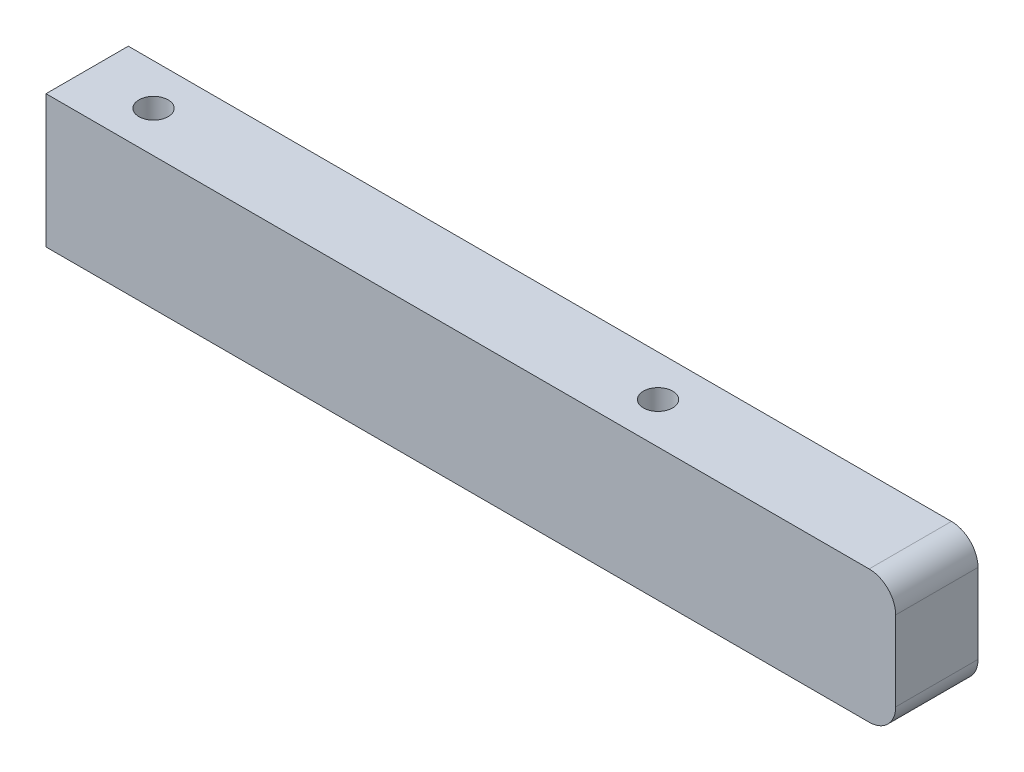
ISO-10303-21;
HEADER;
FILE_DESCRIPTION(('STEP AP214'),'2;1');
FILE_NAME('part.step','',(''),(''),'','','');
FILE_SCHEMA(('AUTOMOTIVE_DESIGN { 1 0 10303 214 1 1 1 1 }'));
ENDSEC;
DATA;
#1=APPLICATION_CONTEXT('core data for automotive mechanical design processes');
#2=APPLICATION_PROTOCOL_DEFINITION('international standard','automotive_design',2000,#1);
#3=PRODUCT_CONTEXT('',#1,'mechanical');
#4=PRODUCT('Part','Part','',(#3));
#5=PRODUCT_RELATED_PRODUCT_CATEGORY('part','',(#4));
#6=PRODUCT_DEFINITION_FORMATION('','',#4);
#7=PRODUCT_DEFINITION_CONTEXT('part definition',#1,'design');
#8=PRODUCT_DEFINITION('design','',#6,#7);
#9=PRODUCT_DEFINITION_SHAPE('','',#8);
#10=(LENGTH_UNIT() NAMED_UNIT(*) SI_UNIT(.MILLI.,.METRE.));
#11=(NAMED_UNIT(*) PLANE_ANGLE_UNIT() SI_UNIT($,.RADIAN.));
#12=(NAMED_UNIT(*) SI_UNIT($,.STERADIAN.) SOLID_ANGLE_UNIT());
#13=UNCERTAINTY_MEASURE_WITH_UNIT(LENGTH_MEASURE(1.E-05),#10,'distance_accuracy_value','');
#14=(GEOMETRIC_REPRESENTATION_CONTEXT(3) GLOBAL_UNCERTAINTY_ASSIGNED_CONTEXT((#13)) GLOBAL_UNIT_ASSIGNED_CONTEXT((#10,
#11,#12)) REPRESENTATION_CONTEXT('',''));
#15=CARTESIAN_POINT('',(0.,0.,0.));
#16=DIRECTION('',(0.,0.,1.));
#17=DIRECTION('',(1.,0.,0.));
#18=AXIS2_PLACEMENT_3D('',#15,#16,#17);
#19=CARTESIAN_POINT('',(80.,-12.5,7.75));
#20=DIRECTION('',(0.,1.,0.));
#21=DIRECTION('',(0.,0.,1.));
#22=AXIS2_PLACEMENT_3D('',#19,#20,#21);
#23=PLANE('',#22);
#24=CARTESIAN_POINT('',(27.5,-12.5,0.));
#25=DIRECTION('',(0.,-1.,0.));
#26=DIRECTION('',(0.,0.,-1.));
#27=AXIS2_PLACEMENT_3D('',#24,#25,#26);
#28=CIRCLE('',#27,5.);
#29=CARTESIAN_POINT('',(27.5,-12.5,-5.));
#30=VERTEX_POINT('',#29);
#31=EDGE_CURVE('E252',#30,#30,#28,.T.);
#32=ORIENTED_EDGE('',*,*,#31,.F.);
#33=EDGE_LOOP('',(#32));
#34=FACE_BOUND('',#33,.T.);
#35=DIRECTION('',(-1.,0.,0.));
#36=VECTOR('',#35,1.);
#37=CARTESIAN_POINT('',(80.,-12.5,-7.75));
#38=LINE('',#37,#36);
#39=CARTESIAN_POINT('',(75.,-12.5,-7.75));
#40=VERTEX_POINT('',#39);
#41=CARTESIAN_POINT('',(-80.,-12.5,-7.75));
#42=VERTEX_POINT('',#41);
#43=EDGE_CURVE('E132',#40,#42,#38,.T.);
#44=ORIENTED_EDGE('',*,*,#43,.F.);
#45=DIRECTION('',(0.,0.,-1.));
#46=VECTOR('',#45,1.);
#47=CARTESIAN_POINT('',(75.,-12.5,7.75));
#48=LINE('',#47,#46);
#49=CARTESIAN_POINT('',(75.,-12.5,7.75));
#50=VERTEX_POINT('',#49);
#51=EDGE_CURVE('E165',#40,#50,#48,.F.);
#52=ORIENTED_EDGE('',*,*,#51,.T.);
#53=DIRECTION('',(-1.,0.,0.));
#54=VECTOR('',#53,1.);
#55=CARTESIAN_POINT('',(80.,-12.5,7.75));
#56=LINE('',#55,#54);
#57=CARTESIAN_POINT('',(-80.,-12.5,7.75));
#58=VERTEX_POINT('',#57);
#59=EDGE_CURVE('E154',#50,#58,#56,.T.);
#60=ORIENTED_EDGE('',*,*,#59,.T.);
#61=DIRECTION('',(0.,0.,-1.));
#62=VECTOR('',#61,1.);
#63=CARTESIAN_POINT('',(-80.,-12.5,7.75));
#64=LINE('',#63,#62);
#65=EDGE_CURVE('E148',#58,#42,#64,.T.);
#66=ORIENTED_EDGE('',*,*,#65,.T.);
#67=EDGE_LOOP('',(#44,#52,#60,#66));
#68=FACE_BOUND('',#67,.T.);
#69=CARTESIAN_POINT('',(-67.5,-12.5,0.));
#70=DIRECTION('',(0.,-1.,0.));
#71=DIRECTION('',(0.,0.,-1.));
#72=AXIS2_PLACEMENT_3D('',#69,#70,#71);
#73=CIRCLE('',#72,5.);
#74=CARTESIAN_POINT('',(-67.5,-12.5,-5.));
#75=VERTEX_POINT('',#74);
#76=EDGE_CURVE('E228',#75,#75,#73,.T.);
#77=ORIENTED_EDGE('',*,*,#76,.F.);
#78=EDGE_LOOP('',(#77));
#79=FACE_BOUND('',#78,.T.);
#80=ADVANCED_FACE('F59',(#34,#68,#79),#23,.F.);
#81=CARTESIAN_POINT('',(80.,-12.5,-7.75));
#82=DIRECTION('',(0.,0.,1.));
#83=DIRECTION('',(1.,0.,0.));
#84=AXIS2_PLACEMENT_3D('',#81,#82,#83);
#85=PLANE('',#84);
#86=DIRECTION('',(-1.,0.,0.));
#87=VECTOR('',#86,1.);
#88=CARTESIAN_POINT('',(80.,12.5,-7.75));
#89=LINE('',#88,#87);
#90=CARTESIAN_POINT('',(75.,12.5,-7.75));
#91=VERTEX_POINT('',#90);
#92=CARTESIAN_POINT('',(-80.,12.5,-7.75));
#93=VERTEX_POINT('',#92);
#94=EDGE_CURVE('E109',#91,#93,#89,.T.);
#95=ORIENTED_EDGE('',*,*,#94,.F.);
#96=CARTESIAN_POINT('',(75.,7.5,-7.75));
#97=DIRECTION('',(0.,0.,1.));
#98=DIRECTION('',(1.,0.,0.));
#99=AXIS2_PLACEMENT_3D('',#96,#97,#98);
#100=CIRCLE('',#99,5.);
#101=CARTESIAN_POINT('',(80.,7.5,-7.75));
#102=VERTEX_POINT('',#101);
#103=EDGE_CURVE('E13',#91,#102,#100,.F.);
#104=ORIENTED_EDGE('',*,*,#103,.T.);
#105=DIRECTION('',(0.,1.,0.));
#106=VECTOR('',#105,1.);
#107=CARTESIAN_POINT('',(80.,-12.5,-7.75));
#108=LINE('',#107,#106);
#109=CARTESIAN_POINT('',(80.,-7.5,-7.75));
#110=VERTEX_POINT('',#109);
#111=EDGE_CURVE('E151',#110,#102,#108,.T.);
#112=ORIENTED_EDGE('',*,*,#111,.F.);
#113=CARTESIAN_POINT('',(75.,-7.5,-7.75));
#114=DIRECTION('',(0.,0.,1.));
#115=DIRECTION('',(1.,0.,0.));
#116=AXIS2_PLACEMENT_3D('',#113,#114,#115);
#117=CIRCLE('',#116,5.);
#118=EDGE_CURVE('E162',#110,#40,#117,.F.);
#119=ORIENTED_EDGE('',*,*,#118,.T.);
#120=ORIENTED_EDGE('',*,*,#43,.T.);
#121=DIRECTION('',(0.,1.,0.));
#122=VECTOR('',#121,1.);
#123=CARTESIAN_POINT('',(-80.,-12.5,-7.75));
#124=LINE('',#123,#122);
#125=EDGE_CURVE('E125',#42,#93,#124,.T.);
#126=ORIENTED_EDGE('',*,*,#125,.T.);
#127=EDGE_LOOP('',(#95,#104,#112,#119,#120,#126));
#128=FACE_BOUND('',#127,.T.);
#129=ADVANCED_FACE('F130',(#128),#85,.F.);
#130=CARTESIAN_POINT('',(80.,12.5,7.75));
#131=DIRECTION('',(0.,-1.,0.));
#132=DIRECTION('',(0.,0.,-1.));
#133=AXIS2_PLACEMENT_3D('',#130,#131,#132);
#134=PLANE('',#133);
#135=CARTESIAN_POINT('',(27.5,12.5,0.));
#136=DIRECTION('',(0.,-1.,0.));
#137=DIRECTION('',(0.,0.,-1.));
#138=AXIS2_PLACEMENT_3D('',#135,#136,#137);
#139=CIRCLE('',#138,2.75);
#140=CARTESIAN_POINT('',(27.5,12.5,-2.74999999999999));
#141=VERTEX_POINT('',#140);
#142=EDGE_CURVE('E234',#141,#141,#139,.T.);
#143=ORIENTED_EDGE('',*,*,#142,.T.);
#144=EDGE_LOOP('',(#143));
#145=FACE_BOUND('',#144,.T.);
#146=CARTESIAN_POINT('',(-67.5,12.5,0.));
#147=DIRECTION('',(0.,-1.,0.));
#148=DIRECTION('',(0.,0.,-1.));
#149=AXIS2_PLACEMENT_3D('',#146,#147,#148);
#150=CIRCLE('',#149,2.74999999999999);
#151=CARTESIAN_POINT('',(-67.5,12.5,-2.74999999999999));
#152=VERTEX_POINT('',#151);
#153=EDGE_CURVE('E135',#152,#152,#150,.T.);
#154=ORIENTED_EDGE('',*,*,#153,.T.);
#155=EDGE_LOOP('',(#154));
#156=FACE_BOUND('',#155,.T.);
#157=DIRECTION('',(-1.,0.,0.));
#158=VECTOR('',#157,1.);
#159=CARTESIAN_POINT('',(80.,12.5,7.75));
#160=LINE('',#159,#158);
#161=CARTESIAN_POINT('',(75.,12.5,7.75));
#162=VERTEX_POINT('',#161);
#163=CARTESIAN_POINT('',(-80.,12.5,7.75));
#164=VERTEX_POINT('',#163);
#165=EDGE_CURVE('E119',#162,#164,#160,.T.);
#166=ORIENTED_EDGE('',*,*,#165,.F.);
#167=DIRECTION('',(0.,0.,1.));
#168=VECTOR('',#167,1.);
#169=CARTESIAN_POINT('',(75.,12.5,7.75));
#170=LINE('',#169,#168);
#171=EDGE_CURVE('E68',#162,#91,#170,.F.);
#172=ORIENTED_EDGE('',*,*,#171,.T.);
#173=ORIENTED_EDGE('',*,*,#94,.T.);
#174=DIRECTION('',(0.,0.,1.));
#175=VECTOR('',#174,1.);
#176=CARTESIAN_POINT('',(-80.,12.5,7.75));
#177=LINE('',#176,#175);
#178=EDGE_CURVE('E112',#93,#164,#177,.T.);
#179=ORIENTED_EDGE('',*,*,#178,.T.);
#180=EDGE_LOOP('',(#166,#172,#173,#179));
#181=FACE_BOUND('',#180,.T.);
#182=ADVANCED_FACE('F111',(#145,#156,#181),#134,.F.);
#183=CARTESIAN_POINT('',(80.,-12.5,7.75));
#184=DIRECTION('',(0.,0.,-1.));
#185=DIRECTION('',(-1.,0.,0.));
#186=AXIS2_PLACEMENT_3D('',#183,#184,#185);
#187=PLANE('',#186);
#188=DIRECTION('',(0.,-1.,0.));
#189=VECTOR('',#188,1.);
#190=CARTESIAN_POINT('',(80.,-12.5,7.75));
#191=LINE('',#190,#189);
#192=CARTESIAN_POINT('',(80.,7.5,7.75));
#193=VERTEX_POINT('',#192);
#194=CARTESIAN_POINT('',(80.,-7.5,7.75));
#195=VERTEX_POINT('',#194);
#196=EDGE_CURVE('E143',#193,#195,#191,.T.);
#197=ORIENTED_EDGE('',*,*,#196,.F.);
#198=CARTESIAN_POINT('',(75.,7.5,7.75));
#199=DIRECTION('',(0.,0.,-1.));
#200=DIRECTION('',(-1.,0.,0.));
#201=AXIS2_PLACEMENT_3D('',#198,#199,#200);
#202=CIRCLE('',#201,5.);
#203=EDGE_CURVE('E82',#193,#162,#202,.F.);
#204=ORIENTED_EDGE('',*,*,#203,.T.);
#205=ORIENTED_EDGE('',*,*,#165,.T.);
#206=DIRECTION('',(0.,-1.,0.));
#207=VECTOR('',#206,1.);
#208=CARTESIAN_POINT('',(-80.,-12.5,7.75));
#209=LINE('',#208,#207);
#210=EDGE_CURVE('E127',#164,#58,#209,.T.);
#211=ORIENTED_EDGE('',*,*,#210,.T.);
#212=ORIENTED_EDGE('',*,*,#59,.F.);
#213=CARTESIAN_POINT('',(75.,-7.5,7.75));
#214=DIRECTION('',(0.,0.,-1.));
#215=DIRECTION('',(-1.,0.,0.));
#216=AXIS2_PLACEMENT_3D('',#213,#214,#215);
#217=CIRCLE('',#216,5.);
#218=EDGE_CURVE('E168',#50,#195,#217,.F.);
#219=ORIENTED_EDGE('',*,*,#218,.T.);
#220=EDGE_LOOP('',(#197,#204,#205,#211,#212,#219));
#221=FACE_BOUND('',#220,.T.);
#222=ADVANCED_FACE('F294',(#221),#187,.F.);
#223=CARTESIAN_POINT('',(80.,0.,0.));
#224=DIRECTION('',(-1.,0.,0.));
#225=DIRECTION('',(0.,0.,1.));
#226=AXIS2_PLACEMENT_3D('',#223,#224,#225);
#227=PLANE('',#226);
#228=ORIENTED_EDGE('',*,*,#111,.T.);
#229=DIRECTION('',(0.,0.,1.));
#230=VECTOR('',#229,1.);
#231=CARTESIAN_POINT('',(80.,7.5,0.));
#232=LINE('',#231,#230);
#233=EDGE_CURVE('E172',#102,#193,#232,.T.);
#234=ORIENTED_EDGE('',*,*,#233,.T.);
#235=ORIENTED_EDGE('',*,*,#196,.T.);
#236=DIRECTION('',(0.,0.,-1.));
#237=VECTOR('',#236,1.);
#238=CARTESIAN_POINT('',(80.,-7.5,0.));
#239=LINE('',#238,#237);
#240=EDGE_CURVE('E118',#195,#110,#239,.T.);
#241=ORIENTED_EDGE('',*,*,#240,.T.);
#242=EDGE_LOOP('',(#228,#234,#235,#241));
#243=FACE_BOUND('',#242,.T.);
#244=ADVANCED_FACE('F291',(#243),#227,.F.);
#245=CARTESIAN_POINT('',(-80.,0.,0.));
#246=DIRECTION('',(-1.,0.,0.));
#247=DIRECTION('',(0.,0.,1.));
#248=AXIS2_PLACEMENT_3D('',#245,#246,#247);
#249=PLANE('',#248);
#250=ORIENTED_EDGE('',*,*,#125,.F.);
#251=ORIENTED_EDGE('',*,*,#65,.F.);
#252=ORIENTED_EDGE('',*,*,#210,.F.);
#253=ORIENTED_EDGE('',*,*,#178,.F.);
#254=EDGE_LOOP('',(#250,#251,#252,#253));
#255=FACE_BOUND('',#254,.T.);
#256=ADVANCED_FACE('F123',(#255),#249,.T.);
#257=CARTESIAN_POINT('',(-67.5,-12.5,0.));
#258=DIRECTION('',(0.,-1.,0.));
#259=DIRECTION('',(0.,0.,-1.));
#260=AXIS2_PLACEMENT_3D('',#257,#258,#259);
#261=CYLINDRICAL_SURFACE('',#260,2.75);
#262=ORIENTED_EDGE('',*,*,#153,.F.);
#263=EDGE_LOOP('',(#262));
#264=FACE_BOUND('',#263,.T.);
#265=CARTESIAN_POINT('',(-67.5,-7.1,0.));
#266=DIRECTION('',(0.,-1.,0.));
#267=DIRECTION('',(0.,0.,-1.));
#268=AXIS2_PLACEMENT_3D('',#265,#266,#267);
#269=CIRCLE('',#268,2.75);
#270=CARTESIAN_POINT('',(-67.5,-7.1,-2.75));
#271=VERTEX_POINT('',#270);
#272=EDGE_CURVE('E140',#271,#271,#269,.T.);
#273=ORIENTED_EDGE('',*,*,#272,.T.);
#274=EDGE_LOOP('',(#273));
#275=FACE_BOUND('',#274,.T.);
#276=ADVANCED_FACE('F282',(#264,#275),#261,.F.);
#277=CARTESIAN_POINT('',(-64.75,-7.1,0.));
#278=DIRECTION('',(0.,1.,0.));
#279=DIRECTION('',(0.,0.,1.));
#280=AXIS2_PLACEMENT_3D('',#277,#278,#279);
#281=PLANE('',#280);
#282=ORIENTED_EDGE('',*,*,#272,.F.);
#283=EDGE_LOOP('',(#282));
#284=FACE_BOUND('',#283,.T.);
#285=CARTESIAN_POINT('',(-67.5,-7.1,0.));
#286=DIRECTION('',(0.,-1.,0.));
#287=DIRECTION('',(0.,0.,-1.));
#288=AXIS2_PLACEMENT_3D('',#285,#286,#287);
#289=CIRCLE('',#288,5.);
#290=CARTESIAN_POINT('',(-67.5,-7.1,-5.));
#291=VERTEX_POINT('',#290);
#292=EDGE_CURVE('E222',#291,#291,#289,.T.);
#293=ORIENTED_EDGE('',*,*,#292,.T.);
#294=EDGE_LOOP('',(#293));
#295=FACE_BOUND('',#294,.T.);
#296=ADVANCED_FACE('F272',(#284,#295),#281,.F.);
#297=CARTESIAN_POINT('',(-67.5,-12.5,0.));
#298=DIRECTION('',(0.,-1.,0.));
#299=DIRECTION('',(0.,0.,-1.));
#300=AXIS2_PLACEMENT_3D('',#297,#298,#299);
#301=CYLINDRICAL_SURFACE('',#300,5.);
#302=ORIENTED_EDGE('',*,*,#292,.F.);
#303=EDGE_LOOP('',(#302));
#304=FACE_BOUND('',#303,.T.);
#305=ORIENTED_EDGE('',*,*,#76,.T.);
#306=EDGE_LOOP('',(#305));
#307=FACE_BOUND('',#306,.T.);
#308=ADVANCED_FACE('F269',(#304,#307),#301,.F.);
#309=CARTESIAN_POINT('',(27.5,-12.5,0.));
#310=DIRECTION('',(0.,-1.,0.));
#311=DIRECTION('',(0.,0.,-1.));
#312=AXIS2_PLACEMENT_3D('',#309,#310,#311);
#313=CYLINDRICAL_SURFACE('',#312,2.75);
#314=ORIENTED_EDGE('',*,*,#142,.F.);
#315=EDGE_LOOP('',(#314));
#316=FACE_BOUND('',#315,.T.);
#317=CARTESIAN_POINT('',(27.5,-7.1,0.));
#318=DIRECTION('',(0.,-1.,0.));
#319=DIRECTION('',(0.,0.,-1.));
#320=AXIS2_PLACEMENT_3D('',#317,#318,#319);
#321=CIRCLE('',#320,2.75);
#322=CARTESIAN_POINT('',(27.5,-7.1,-2.75));
#323=VERTEX_POINT('',#322);
#324=EDGE_CURVE('E240',#323,#323,#321,.T.);
#325=ORIENTED_EDGE('',*,*,#324,.T.);
#326=EDGE_LOOP('',(#325));
#327=FACE_BOUND('',#326,.T.);
#328=ADVANCED_FACE('F271',(#316,#327),#313,.F.);
#329=CARTESIAN_POINT('',(30.25,-7.1,0.));
#330=DIRECTION('',(0.,1.,0.));
#331=DIRECTION('',(0.,0.,1.));
#332=AXIS2_PLACEMENT_3D('',#329,#330,#331);
#333=PLANE('',#332);
#334=ORIENTED_EDGE('',*,*,#324,.F.);
#335=EDGE_LOOP('',(#334));
#336=FACE_BOUND('',#335,.T.);
#337=CARTESIAN_POINT('',(27.5,-7.1,0.));
#338=DIRECTION('',(0.,-1.,0.));
#339=DIRECTION('',(0.,0.,-1.));
#340=AXIS2_PLACEMENT_3D('',#337,#338,#339);
#341=CIRCLE('',#340,5.);
#342=CARTESIAN_POINT('',(27.5,-7.1,-4.99999999999999));
#343=VERTEX_POINT('',#342);
#344=EDGE_CURVE('E246',#343,#343,#341,.T.);
#345=ORIENTED_EDGE('',*,*,#344,.T.);
#346=EDGE_LOOP('',(#345));
#347=FACE_BOUND('',#346,.T.);
#348=ADVANCED_FACE('F279',(#336,#347),#333,.F.);
#349=CARTESIAN_POINT('',(27.5,-12.5,0.));
#350=DIRECTION('',(0.,-1.,0.));
#351=DIRECTION('',(0.,0.,-1.));
#352=AXIS2_PLACEMENT_3D('',#349,#350,#351);
#353=CYLINDRICAL_SURFACE('',#352,5.);
#354=ORIENTED_EDGE('',*,*,#344,.F.);
#355=EDGE_LOOP('',(#354));
#356=FACE_BOUND('',#355,.T.);
#357=ORIENTED_EDGE('',*,*,#31,.T.);
#358=EDGE_LOOP('',(#357));
#359=FACE_BOUND('',#358,.T.);
#360=ADVANCED_FACE('F260',(#356,#359),#353,.F.);
#361=CARTESIAN_POINT('',(75.,-7.5,0.));
#362=DIRECTION('',(0.,0.,-1.));
#363=DIRECTION('',(-1.,0.,0.));
#364=AXIS2_PLACEMENT_3D('',#361,#362,#363);
#365=CYLINDRICAL_SURFACE('',#364,5.);
#366=ORIENTED_EDGE('',*,*,#218,.F.);
#367=ORIENTED_EDGE('',*,*,#51,.F.);
#368=ORIENTED_EDGE('',*,*,#118,.F.);
#369=ORIENTED_EDGE('',*,*,#240,.F.);
#370=EDGE_LOOP('',(#366,#367,#368,#369));
#371=FACE_BOUND('',#370,.T.);
#372=ADVANCED_FACE('F304',(#371),#365,.T.);
#373=CARTESIAN_POINT('',(75.,7.5,0.));
#374=DIRECTION('',(0.,0.,1.));
#375=DIRECTION('',(1.,0.,0.));
#376=AXIS2_PLACEMENT_3D('',#373,#374,#375);
#377=CYLINDRICAL_SURFACE('',#376,5.);
#378=ORIENTED_EDGE('',*,*,#103,.F.);
#379=ORIENTED_EDGE('',*,*,#171,.F.);
#380=ORIENTED_EDGE('',*,*,#203,.F.);
#381=ORIENTED_EDGE('',*,*,#233,.F.);
#382=EDGE_LOOP('',(#378,#379,#380,#381));
#383=FACE_BOUND('',#382,.T.);
#384=ADVANCED_FACE('F61',(#383),#377,.T.);
#385=CLOSED_SHELL('',(#80,#129,#182,#222,#244,#256,#276,#296,#308,#328,#348,#360,#372,#384));
#386=MANIFOLD_SOLID_BREP('B2',#385);
#387=ADVANCED_BREP_SHAPE_REPRESENTATION('',(#18,#386),#14);
#388=SHAPE_DEFINITION_REPRESENTATION(#9,#387);
ENDSEC;
END-ISO-10303-21;
